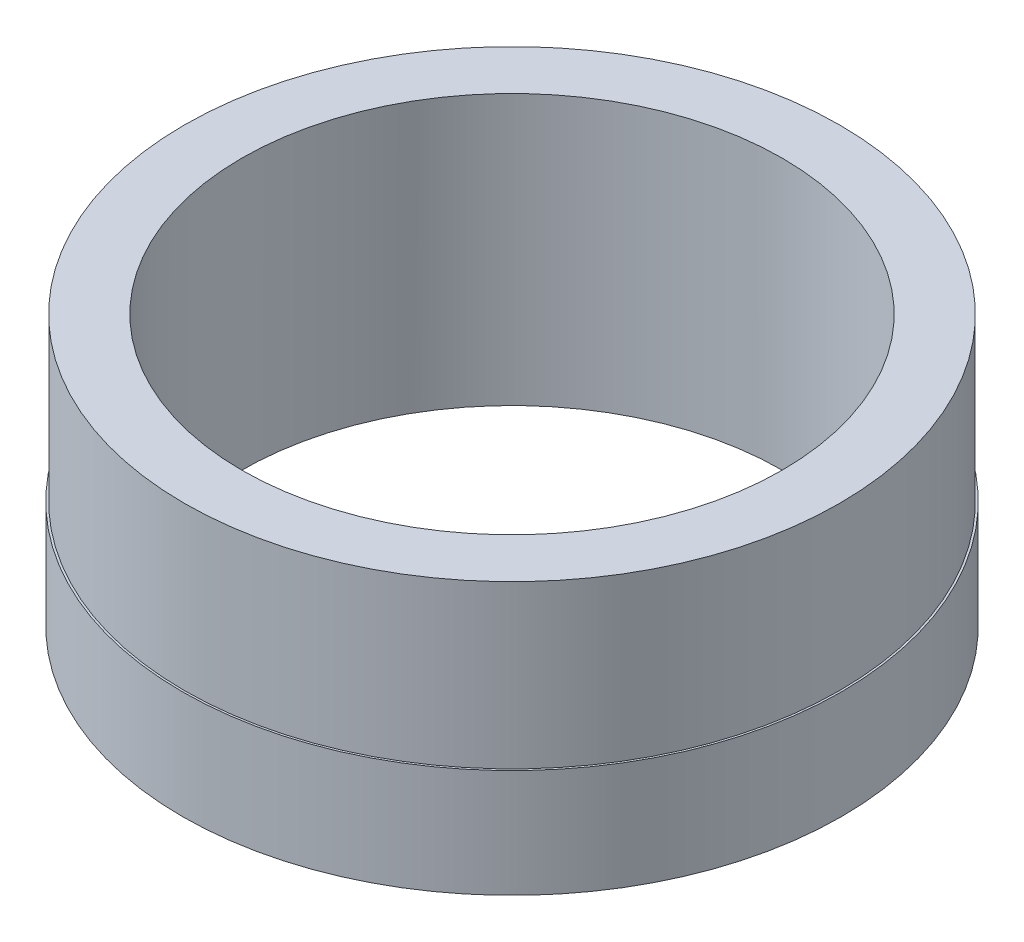
ISO-10303-21;
HEADER;
FILE_DESCRIPTION(('STEP AP214'),'2;1');
FILE_NAME('part.step','',(''),(''),'','','');
FILE_SCHEMA(('AUTOMOTIVE_DESIGN { 1 0 10303 214 1 1 1 1 }'));
ENDSEC;
DATA;
#1=APPLICATION_CONTEXT('core data for automotive mechanical design processes');
#2=APPLICATION_PROTOCOL_DEFINITION('international standard','automotive_design',2000,#1);
#3=PRODUCT_CONTEXT('',#1,'mechanical');
#4=PRODUCT('Part','Part','',(#3));
#5=PRODUCT_RELATED_PRODUCT_CATEGORY('part','',(#4));
#6=PRODUCT_DEFINITION_FORMATION('','',#4);
#7=PRODUCT_DEFINITION_CONTEXT('part definition',#1,'design');
#8=PRODUCT_DEFINITION('design','',#6,#7);
#9=PRODUCT_DEFINITION_SHAPE('','',#8);
#10=(LENGTH_UNIT() NAMED_UNIT(*) SI_UNIT(.MILLI.,.METRE.));
#11=(NAMED_UNIT(*) PLANE_ANGLE_UNIT() SI_UNIT($,.RADIAN.));
#12=(NAMED_UNIT(*) SI_UNIT($,.STERADIAN.) SOLID_ANGLE_UNIT());
#13=UNCERTAINTY_MEASURE_WITH_UNIT(LENGTH_MEASURE(1.E-05),#10,'distance_accuracy_value','');
#14=(GEOMETRIC_REPRESENTATION_CONTEXT(3) GLOBAL_UNCERTAINTY_ASSIGNED_CONTEXT((#13)) GLOBAL_UNIT_ASSIGNED_CONTEXT((#10,
#11,#12)) REPRESENTATION_CONTEXT('',''));
#15=CARTESIAN_POINT('',(0.,0.,0.));
#16=DIRECTION('',(0.,0.,1.));
#17=DIRECTION('',(1.,0.,0.));
#18=AXIS2_PLACEMENT_3D('',#15,#16,#17);
#19=CARTESIAN_POINT('',(0.,8.,0.));
#20=DIRECTION('',(0.,-1.,0.));
#21=DIRECTION('',(0.,0.,-1.));
#22=AXIS2_PLACEMENT_3D('',#19,#20,#21);
#23=CYLINDRICAL_SURFACE('',#22,24.4);
#24=CARTESIAN_POINT('',(0.,8.,0.));
#25=DIRECTION('',(0.,1.,0.));
#26=DIRECTION('',(0.,0.,1.));
#27=AXIS2_PLACEMENT_3D('',#24,#25,#26);
#28=CIRCLE('',#27,24.4);
#29=CARTESIAN_POINT('',(0.,8.,24.4));
#30=VERTEX_POINT('',#29);
#31=EDGE_CURVE('E38',#30,#30,#28,.T.);
#32=ORIENTED_EDGE('',*,*,#31,.F.);
#33=EDGE_LOOP('',(#32));
#34=FACE_BOUND('',#33,.T.);
#35=CARTESIAN_POINT('',(0.,0.,0.));
#36=DIRECTION('',(0.,1.,0.));
#37=DIRECTION('',(0.,0.,1.));
#38=AXIS2_PLACEMENT_3D('',#35,#36,#37);
#39=CIRCLE('',#38,24.4);
#40=CARTESIAN_POINT('',(0.,0.,24.4));
#41=VERTEX_POINT('',#40);
#42=EDGE_CURVE('E43',#41,#41,#39,.T.);
#43=ORIENTED_EDGE('',*,*,#42,.T.);
#44=EDGE_LOOP('',(#43));
#45=FACE_BOUND('',#44,.T.);
#46=ADVANCED_FACE('F31',(#34,#45),#23,.T.);
#47=CARTESIAN_POINT('',(0.,8.,0.));
#48=DIRECTION('',(0.,1.,0.));
#49=DIRECTION('',(0.,0.,1.));
#50=AXIS2_PLACEMENT_3D('',#47,#48,#49);
#51=PLANE('',#50);
#52=CARTESIAN_POINT('',(0.,8.,0.));
#53=DIRECTION('',(0.,1.,0.));
#54=DIRECTION('',(0.,0.,1.));
#55=AXIS2_PLACEMENT_3D('',#52,#53,#54);
#56=CIRCLE('',#55,24.25);
#57=CARTESIAN_POINT('',(0.,8.,24.25));
#58=VERTEX_POINT('',#57);
#59=EDGE_CURVE('E10',#58,#58,#56,.T.);
#60=ORIENTED_EDGE('',*,*,#59,.F.);
#61=EDGE_LOOP('',(#60));
#62=FACE_BOUND('',#61,.T.);
#63=ORIENTED_EDGE('',*,*,#31,.T.);
#64=EDGE_LOOP('',(#63));
#65=FACE_BOUND('',#64,.T.);
#66=ADVANCED_FACE('F67',(#62,#65),#51,.T.);
#67=CARTESIAN_POINT('',(0.,0.,0.));
#68=DIRECTION('',(0.,1.,0.));
#69=DIRECTION('',(0.,0.,1.));
#70=AXIS2_PLACEMENT_3D('',#67,#68,#69);
#71=PLANE('',#70);
#72=CARTESIAN_POINT('',(0.,0.,0.));
#73=DIRECTION('',(0.,-1.,0.));
#74=DIRECTION('',(0.,0.,-1.));
#75=AXIS2_PLACEMENT_3D('',#72,#73,#74);
#76=CIRCLE('',#75,20.);
#77=CARTESIAN_POINT('',(0.,0.,-20.));
#78=VERTEX_POINT('',#77);
#79=EDGE_CURVE('E55',#78,#78,#76,.T.);
#80=ORIENTED_EDGE('',*,*,#79,.F.);
#81=EDGE_LOOP('',(#80));
#82=FACE_BOUND('',#81,.T.);
#83=ORIENTED_EDGE('',*,*,#42,.F.);
#84=EDGE_LOOP('',(#83));
#85=FACE_BOUND('',#84,.T.);
#86=ADVANCED_FACE('F63',(#82,#85),#71,.F.);
#87=CARTESIAN_POINT('',(0.,20.,0.));
#88=DIRECTION('',(0.,-1.,0.));
#89=DIRECTION('',(0.,0.,-1.));
#90=AXIS2_PLACEMENT_3D('',#87,#88,#89);
#91=CYLINDRICAL_SURFACE('',#90,24.25);
#92=CARTESIAN_POINT('',(0.,20.,0.));
#93=DIRECTION('',(0.,1.,0.));
#94=DIRECTION('',(0.,0.,1.));
#95=AXIS2_PLACEMENT_3D('',#92,#93,#94);
#96=CIRCLE('',#95,24.25);
#97=CARTESIAN_POINT('',(0.,20.,24.25));
#98=VERTEX_POINT('',#97);
#99=EDGE_CURVE('E46',#98,#98,#96,.T.);
#100=ORIENTED_EDGE('',*,*,#99,.F.);
#101=EDGE_LOOP('',(#100));
#102=FACE_BOUND('',#101,.T.);
#103=ORIENTED_EDGE('',*,*,#59,.T.);
#104=EDGE_LOOP('',(#103));
#105=FACE_BOUND('',#104,.T.);
#106=ADVANCED_FACE('F66',(#102,#105),#91,.T.);
#107=CARTESIAN_POINT('',(0.,20.,0.));
#108=DIRECTION('',(0.,1.,0.));
#109=DIRECTION('',(0.,0.,1.));
#110=AXIS2_PLACEMENT_3D('',#107,#108,#109);
#111=PLANE('',#110);
#112=CARTESIAN_POINT('',(0.,20.,0.));
#113=DIRECTION('',(0.,1.,0.));
#114=DIRECTION('',(0.,0.,1.));
#115=AXIS2_PLACEMENT_3D('',#112,#113,#114);
#116=CIRCLE('',#115,20.);
#117=CARTESIAN_POINT('',(0.,20.,20.));
#118=VERTEX_POINT('',#117);
#119=EDGE_CURVE('E34',#118,#118,#116,.T.);
#120=ORIENTED_EDGE('',*,*,#119,.F.);
#121=EDGE_LOOP('',(#120));
#122=FACE_BOUND('',#121,.T.);
#123=ORIENTED_EDGE('',*,*,#99,.T.);
#124=EDGE_LOOP('',(#123));
#125=FACE_BOUND('',#124,.T.);
#126=ADVANCED_FACE('F72',(#122,#125),#111,.T.);
#127=CARTESIAN_POINT('',(0.,29.,0.));
#128=DIRECTION('',(0.,-1.,0.));
#129=DIRECTION('',(0.,0.,-1.));
#130=AXIS2_PLACEMENT_3D('',#127,#128,#129);
#131=CYLINDRICAL_SURFACE('',#130,20.);
#132=ORIENTED_EDGE('',*,*,#119,.T.);
#133=EDGE_LOOP('',(#132));
#134=FACE_BOUND('',#133,.T.);
#135=ORIENTED_EDGE('',*,*,#79,.T.);
#136=EDGE_LOOP('',(#135));
#137=FACE_BOUND('',#136,.T.);
#138=ADVANCED_FACE('F61',(#134,#137),#131,.F.);
#139=CLOSED_SHELL('',(#46,#66,#86,#106,#126,#138));
#140=MANIFOLD_SOLID_BREP('B2',#139);
#141=ADVANCED_BREP_SHAPE_REPRESENTATION('',(#18,#140),#14);
#142=SHAPE_DEFINITION_REPRESENTATION(#9,#141);
ENDSEC;
END-ISO-10303-21;
